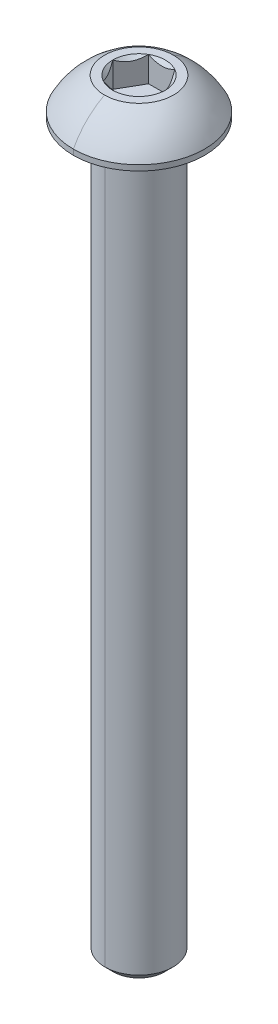
ISO-10303-21;
HEADER;
FILE_DESCRIPTION(('STEP AP214'),'2;1');
FILE_NAME('part.step','',(''),(''),'','','');
FILE_SCHEMA(('AUTOMOTIVE_DESIGN { 1 0 10303 214 1 1 1 1 }'));
ENDSEC;
DATA;
#1=APPLICATION_CONTEXT('core data for automotive mechanical design processes');
#2=APPLICATION_PROTOCOL_DEFINITION('international standard','automotive_design',2000,#1);
#3=PRODUCT_CONTEXT('',#1,'mechanical');
#4=PRODUCT('Part','Part','',(#3));
#5=PRODUCT_RELATED_PRODUCT_CATEGORY('part','',(#4));
#6=PRODUCT_DEFINITION_FORMATION('','',#4);
#7=PRODUCT_DEFINITION_CONTEXT('part definition',#1,'design');
#8=PRODUCT_DEFINITION('design','',#6,#7);
#9=PRODUCT_DEFINITION_SHAPE('','',#8);
#10=(LENGTH_UNIT() NAMED_UNIT(*) SI_UNIT(.MILLI.,.METRE.));
#11=(NAMED_UNIT(*) PLANE_ANGLE_UNIT() SI_UNIT($,.RADIAN.));
#12=(NAMED_UNIT(*) SI_UNIT($,.STERADIAN.) SOLID_ANGLE_UNIT());
#13=UNCERTAINTY_MEASURE_WITH_UNIT(LENGTH_MEASURE(1.E-05),#10,'distance_accuracy_value','');
#14=(GEOMETRIC_REPRESENTATION_CONTEXT(3) GLOBAL_UNCERTAINTY_ASSIGNED_CONTEXT((#13)) GLOBAL_UNIT_ASSIGNED_CONTEXT((#10,
#11,#12)) REPRESENTATION_CONTEXT('',''));
#15=CARTESIAN_POINT('',(0.,0.,0.));
#16=DIRECTION('',(0.,0.,1.));
#17=DIRECTION('',(1.,0.,0.));
#18=AXIS2_PLACEMENT_3D('',#15,#16,#17);
#19=CARTESIAN_POINT('',(0.,-0.152399999999997,0.));
#20=DIRECTION('',(0.,1.,0.));
#21=DIRECTION('',(0.,0.,1.));
#22=AXIS2_PLACEMENT_3D('',#19,#20,#21);
#23=TOROIDAL_SURFACE('',#22,2.5273,0.1524);
#24=CARTESIAN_POINT('',(0.,-0.152399999999997,-2.5273));
#25=DIRECTION('',(1.,0.,0.));
#26=DIRECTION('',(0.,0.,-1.));
#27=AXIS2_PLACEMENT_3D('',#24,#25,#26);
#28=CIRCLE('',#27,0.1524);
#29=CARTESIAN_POINT('',(0.,0.,-2.5273));
#30=VERTEX_POINT('',#29);
#31=CARTESIAN_POINT('',(0.,-0.152399999999997,-2.3749));
#32=VERTEX_POINT('',#31);
#33=EDGE_CURVE('E255',#30,#32,#28,.T.);
#34=ORIENTED_EDGE('',*,*,#33,.F.);
#35=CARTESIAN_POINT('',(0.,0.,0.));
#36=DIRECTION('',(0.,1.,0.));
#37=DIRECTION('',(0.,0.,1.));
#38=AXIS2_PLACEMENT_3D('',#35,#36,#37);
#39=CIRCLE('',#38,2.5273);
#40=CARTESIAN_POINT('',(0.,0.,2.5273));
#41=VERTEX_POINT('',#40);
#42=EDGE_CURVE('E146',#41,#30,#39,.T.);
#43=ORIENTED_EDGE('',*,*,#42,.F.);
#44=CARTESIAN_POINT('',(0.,-0.152399999999997,2.5273));
#45=DIRECTION('',(-1.,0.,0.));
#46=DIRECTION('',(0.,0.,1.));
#47=AXIS2_PLACEMENT_3D('',#44,#45,#46);
#48=CIRCLE('',#47,0.1524);
#49=CARTESIAN_POINT('',(0.,-0.152399999999997,2.3749));
#50=VERTEX_POINT('',#49);
#51=EDGE_CURVE('E199',#41,#50,#48,.T.);
#52=ORIENTED_EDGE('',*,*,#51,.T.);
#53=CARTESIAN_POINT('',(0.,-0.152399999999997,0.));
#54=DIRECTION('',(0.,-1.,0.));
#55=DIRECTION('',(0.,0.,1.));
#56=AXIS2_PLACEMENT_3D('',#53,#54,#55);
#57=CIRCLE('',#56,2.3749);
#58=EDGE_CURVE('E209',#32,#50,#57,.T.);
#59=ORIENTED_EDGE('',*,*,#58,.F.);
#60=EDGE_LOOP('',(#34,#43,#52,#59));
#61=FACE_BOUND('',#60,.T.);
#62=ADVANCED_FACE('F16',(#61),#23,.F.);
#63=CARTESIAN_POINT('',(0.,2.5654,0.));
#64=DIRECTION('',(0.,1.,0.));
#65=DIRECTION('',(0.,0.,1.));
#66=AXIS2_PLACEMENT_3D('',#63,#64,#65);
#67=CONICAL_SURFACE('',#66,1.83308710467706,0.78539816339745);
#68=DIRECTION('',(0.,0.707106781186546,-0.707106781186549));
#69=VECTOR('',#68,1.);
#70=CARTESIAN_POINT('',(0.,2.5654,-1.83308710467706));
#71=LINE('',#70,#69);
#72=CARTESIAN_POINT('',(0.,0.732312895322944,0.));
#73=VERTEX_POINT('',#72);
#74=CARTESIAN_POINT('',(0.,0.7874,-0.0550871046770556));
#75=VERTEX_POINT('',#74);
#76=EDGE_CURVE('E227',#73,#75,#71,.T.);
#77=ORIENTED_EDGE('',*,*,#76,.F.);
#78=DIRECTION('',(0.,0.707106781186546,0.707106781186549));
#79=VECTOR('',#78,1.);
#80=CARTESIAN_POINT('',(0.,2.5654,1.83308710467706));
#81=LINE('',#80,#79);
#82=CARTESIAN_POINT('',(0.,0.7874,0.0550871046770556));
#83=VERTEX_POINT('',#82);
#84=EDGE_CURVE('E203',#73,#83,#81,.T.);
#85=ORIENTED_EDGE('',*,*,#84,.T.);
#86=CARTESIAN_POINT('',(0.,0.7874,0.));
#87=DIRECTION('',(0.,1.,0.));
#88=DIRECTION('',(0.,0.,1.));
#89=AXIS2_PLACEMENT_3D('',#86,#87,#88);
#90=CIRCLE('',#89,0.0550871046770558);
#91=EDGE_CURVE('E188',#83,#75,#90,.T.);
#92=ORIENTED_EDGE('',*,*,#91,.T.);
#93=EDGE_LOOP('',(#77,#85,#92));
#94=FACE_BOUND('',#93,.T.);
#95=ADVANCED_FACE('F295',(#94),#67,.F.);
#96=CARTESIAN_POINT('',(1.83308710467706,0.7874,0.));
#97=DIRECTION('',(0.866025403784439,0.,-0.5));
#98=DIRECTION('',(0.,-1.,0.));
#99=AXIS2_PLACEMENT_3D('',#96,#97,#98);
#100=PLANE('',#99);
#101=DIRECTION('',(0.,1.,0.));
#102=VECTOR('',#101,1.);
#103=CARTESIAN_POINT('',(1.83308710467706,0.7874,0.));
#104=LINE('',#103,#102);
#105=CARTESIAN_POINT('',(1.83308710467706,0.7874,0.));
#106=VERTEX_POINT('',#105);
#107=CARTESIAN_POINT('',(1.83308710467706,2.5654,0.));
#108=VERTEX_POINT('',#107);
#109=EDGE_CURVE('E11',#106,#108,#104,.T.);
#110=ORIENTED_EDGE('',*,*,#109,.T.);
#111=CARTESIAN_POINT('',(1.83308710467706,2.5654,0.));
#112=CARTESIAN_POINT('',(1.58854939316106,2.32086228848399,-0.423551740712339));
#113=CARTESIAN_POINT('',(1.37650342717985,2.31981648546325,-0.790826127331817));
#114=CARTESIAN_POINT('',(1.16317917435944,2.31876437797812,-1.16031457170343));
#115=CARTESIAN_POINT('',(0.91654355233853,2.5654,-1.5875));
#116=B_SPLINE_CURVE_WITH_KNOTS('',2,(#111,#112,#113,#114,#115),.UNSPECIFIED.,.F.,.F.,(3,2,3),
(0.,0.5,1.),.UNSPECIFIED.);
#117=CARTESIAN_POINT('',(0.916543552338531,2.5654,-1.5875));
#118=VERTEX_POINT('',#117);
#119=EDGE_CURVE('E183',#108,#118,#116,.T.);
#120=ORIENTED_EDGE('',*,*,#119,.T.);
#121=DIRECTION('',(0.,1.,0.));
#122=VECTOR('',#121,1.);
#123=CARTESIAN_POINT('',(0.916543552338531,0.7874,-1.5875));
#124=LINE('',#123,#122);
#125=CARTESIAN_POINT('',(0.916543552338531,0.7874,-1.5875));
#126=VERTEX_POINT('',#125);
#127=EDGE_CURVE('E191',#126,#118,#124,.T.);
#128=ORIENTED_EDGE('',*,*,#127,.F.);
#129=DIRECTION('',(-0.5,0.,-0.866025403784439));
#130=VECTOR('',#129,1.);
#131=CARTESIAN_POINT('',(1.83308710467706,0.7874,0.));
#132=LINE('',#131,#130);
#133=EDGE_CURVE('E178',#106,#126,#132,.T.);
#134=ORIENTED_EDGE('',*,*,#133,.F.);
#135=EDGE_LOOP('',(#110,#120,#128,#134));
#136=FACE_BOUND('',#135,.T.);
#137=ADVANCED_FACE('F284',(#136),#100,.F.);
#138=CARTESIAN_POINT('',(0.916543552338531,0.7874,1.5875));
#139=DIRECTION('',(0.866025403784439,0.,0.5));
#140=DIRECTION('',(0.,-1.,0.));
#141=AXIS2_PLACEMENT_3D('',#138,#139,#140);
#142=PLANE('',#141);
#143=DIRECTION('',(0.,1.,0.));
#144=VECTOR('',#143,1.);
#145=CARTESIAN_POINT('',(0.916543552338531,0.7874,1.5875));
#146=LINE('',#145,#144);
#147=CARTESIAN_POINT('',(0.916543552338531,0.7874,1.5875));
#148=VERTEX_POINT('',#147);
#149=CARTESIAN_POINT('',(0.916543552338531,2.5654,1.5875));
#150=VERTEX_POINT('',#149);
#151=EDGE_CURVE('E30',#148,#150,#146,.T.);
#152=ORIENTED_EDGE('',*,*,#151,.T.);
#153=CARTESIAN_POINT('',(0.916543552338531,2.5654,1.5875));
#154=CARTESIAN_POINT('',(1.16108126385472,2.32086228848382,1.16394825928734));
#155=CARTESIAN_POINT('',(1.37312722983574,2.31981648546325,0.796673872668184));
#156=CARTESIAN_POINT('',(1.58645148265633,2.3187643779783,0.427185428296259));
#157=CARTESIAN_POINT('',(1.83308710467706,2.5654,0.));
#158=B_SPLINE_CURVE_WITH_KNOTS('',2,(#153,#154,#155,#156,#157),.UNSPECIFIED.,.F.,.F.,(3,2,3),
(0.,0.5,1.),.UNSPECIFIED.);
#159=EDGE_CURVE('E327',#150,#108,#158,.T.);
#160=ORIENTED_EDGE('',*,*,#159,.T.);
#161=ORIENTED_EDGE('',*,*,#109,.F.);
#162=DIRECTION('',(0.5,0.,-0.866025403784439));
#163=VECTOR('',#162,1.);
#164=CARTESIAN_POINT('',(0.916543552338531,0.7874,1.5875));
#165=LINE('',#164,#163);
#166=EDGE_CURVE('E192',#148,#106,#165,.T.);
#167=ORIENTED_EDGE('',*,*,#166,.F.);
#168=EDGE_LOOP('',(#152,#160,#161,#167));
#169=FACE_BOUND('',#168,.T.);
#170=ADVANCED_FACE('F294',(#169),#142,.F.);
#171=CARTESIAN_POINT('',(-0.91654355233853,0.7874,1.5875));
#172=DIRECTION('',(0.,0.,1.));
#173=DIRECTION('',(1.,0.,0.));
#174=AXIS2_PLACEMENT_3D('',#171,#172,#173);
#175=PLANE('',#174);
#176=DIRECTION('',(0.,1.,0.));
#177=VECTOR('',#176,1.);
#178=CARTESIAN_POINT('',(-0.91654355233853,0.7874,1.5875));
#179=LINE('',#178,#177);
#180=CARTESIAN_POINT('',(-0.91654355233853,0.7874,1.5875));
#181=VERTEX_POINT('',#180);
#182=CARTESIAN_POINT('',(-0.91654355233853,2.5654,1.5875));
#183=VERTEX_POINT('',#182);
#184=EDGE_CURVE('E410',#181,#183,#179,.T.);
#185=ORIENTED_EDGE('',*,*,#184,.T.);
#186=CARTESIAN_POINT('',(-0.916543552338531,2.5654,1.5875));
#187=CARTESIAN_POINT('',(-0.684381010738564,2.44931872920002,1.5875));
#188=CARTESIAN_POINT('',(-0.4718738638875,2.38845938444161,1.5875));
#189=CARTESIAN_POINT('',(-0.232175759974894,2.31981289532294,1.5875));
#190=CARTESIAN_POINT('',(0.,2.31981289532294,1.5875));
#191=B_SPLINE_CURVE_WITH_KNOTS('',2,(#186,#187,#188,#189,#190),.UNSPECIFIED.,.F.,.F.,(3,2,3),
(0.,0.5,1.),.UNSPECIFIED.);
#192=CARTESIAN_POINT('',(0.,2.31981289532294,1.5875));
#193=VERTEX_POINT('',#192);
#194=EDGE_CURVE('E405',#183,#193,#191,.T.);
#195=ORIENTED_EDGE('',*,*,#194,.T.);
#196=CARTESIAN_POINT('',(0.,2.31981289532294,1.5875));
#197=CARTESIAN_POINT('',(0.229732695645398,2.31981289532294,1.5875));
#198=CARTESIAN_POINT('',(0.471961624215038,2.3884843914945,1.5875));
#199=CARTESIAN_POINT('',(0.68154594324368,2.44790119545257,1.5875));
#200=CARTESIAN_POINT('',(0.91654355233853,2.5654,1.5875));
#201=B_SPLINE_CURVE_WITH_KNOTS('',2,(#196,#197,#198,#199,#200),.UNSPECIFIED.,.F.,.F.,(3,2,3),
(0.,0.5,1.),.UNSPECIFIED.);
#202=EDGE_CURVE('E226',#193,#150,#201,.T.);
#203=ORIENTED_EDGE('',*,*,#202,.T.);
#204=ORIENTED_EDGE('',*,*,#151,.F.);
#205=DIRECTION('',(1.,0.,0.));
#206=VECTOR('',#205,1.);
#207=CARTESIAN_POINT('',(-0.91654355233853,0.7874,1.5875));
#208=LINE('',#207,#206);
#209=EDGE_CURVE('E197',#181,#148,#208,.T.);
#210=ORIENTED_EDGE('',*,*,#209,.F.);
#211=EDGE_LOOP('',(#185,#195,#203,#204,#210));
#212=FACE_BOUND('',#211,.T.);
#213=ADVANCED_FACE('F18',(#212),#175,.F.);
#214=CARTESIAN_POINT('',(-1.83308710467706,0.7874,0.));
#215=DIRECTION('',(-0.866025403784439,0.,0.5));
#216=DIRECTION('',(0.,1.,0.));
#217=AXIS2_PLACEMENT_3D('',#214,#215,#216);
#218=PLANE('',#217);
#219=DIRECTION('',(0.,1.,0.));
#220=VECTOR('',#219,1.);
#221=CARTESIAN_POINT('',(-1.83308710467706,0.7874,0.));
#222=LINE('',#221,#220);
#223=CARTESIAN_POINT('',(-1.83308710467706,0.7874,0.));
#224=VERTEX_POINT('',#223);
#225=CARTESIAN_POINT('',(-1.83308710467706,2.5654,0.));
#226=VERTEX_POINT('',#225);
#227=EDGE_CURVE('E471',#224,#226,#222,.T.);
#228=ORIENTED_EDGE('',*,*,#227,.T.);
#229=CARTESIAN_POINT('',(-1.83308710467706,2.5654,0.));
#230=CARTESIAN_POINT('',(-1.58854939316106,2.32086228848399,0.423551740712331));
#231=CARTESIAN_POINT('',(-1.37650342717985,2.31981648546325,0.790826127331817));
#232=CARTESIAN_POINT('',(-1.16317917435944,2.31876437797812,1.16031457170343));
#233=CARTESIAN_POINT('',(-0.91654355233853,2.5654,1.5875));
#234=B_SPLINE_CURVE_WITH_KNOTS('',2,(#229,#230,#231,#232,#233),.UNSPECIFIED.,.F.,.F.,(3,2,3),
(0.,0.5,1.),.UNSPECIFIED.);
#235=EDGE_CURVE('E415',#226,#183,#234,.T.);
#236=ORIENTED_EDGE('',*,*,#235,.T.);
#237=ORIENTED_EDGE('',*,*,#184,.F.);
#238=DIRECTION('',(0.5,0.,0.866025403784438));
#239=VECTOR('',#238,1.);
#240=CARTESIAN_POINT('',(-1.83308710467706,0.7874,0.));
#241=LINE('',#240,#239);
#242=EDGE_CURVE('E193',#224,#181,#241,.T.);
#243=ORIENTED_EDGE('',*,*,#242,.F.);
#244=EDGE_LOOP('',(#228,#236,#237,#243));
#245=FACE_BOUND('',#244,.T.);
#246=ADVANCED_FACE('F496',(#245),#218,.F.);
#247=CARTESIAN_POINT('',(-0.916543552338531,0.7874,-1.5875));
#248=DIRECTION('',(-0.866025403784439,0.,-0.5));
#249=DIRECTION('',(-0.5,0.,0.866025403784439));
#250=AXIS2_PLACEMENT_3D('',#247,#248,#249);
#251=PLANE('',#250);
#252=DIRECTION('',(0.,1.,0.));
#253=VECTOR('',#252,1.);
#254=CARTESIAN_POINT('',(-0.916543552338531,0.7874,-1.5875));
#255=LINE('',#254,#253);
#256=CARTESIAN_POINT('',(-0.916543552338531,0.7874,-1.5875));
#257=VERTEX_POINT('',#256);
#258=CARTESIAN_POINT('',(-0.916543552338531,2.5654,-1.5875));
#259=VERTEX_POINT('',#258);
#260=EDGE_CURVE('E528',#257,#259,#255,.T.);
#261=ORIENTED_EDGE('',*,*,#260,.T.);
#262=CARTESIAN_POINT('',(-0.916543552338531,2.5654,-1.5875));
#263=CARTESIAN_POINT('',(-1.16108126385453,2.320862288484,-1.16394825928767));
#264=CARTESIAN_POINT('',(-1.37312722983574,2.31981648546325,-0.796673872668183));
#265=CARTESIAN_POINT('',(-1.58645148265615,2.31876437797813,-0.427185428296571));
#266=CARTESIAN_POINT('',(-1.83308710467706,2.5654,0.));
#267=B_SPLINE_CURVE_WITH_KNOTS('',2,(#262,#263,#264,#265,#266),.UNSPECIFIED.,.F.,.F.,(3,2,3),
(0.,0.5,1.),.UNSPECIFIED.);
#268=EDGE_CURVE('E544',#259,#226,#267,.T.);
#269=ORIENTED_EDGE('',*,*,#268,.T.);
#270=ORIENTED_EDGE('',*,*,#227,.F.);
#271=DIRECTION('',(-0.5,0.,0.866025403784439));
#272=VECTOR('',#271,1.);
#273=CARTESIAN_POINT('',(-0.916543552338531,0.7874,-1.5875));
#274=LINE('',#273,#272);
#275=EDGE_CURVE('E198',#257,#224,#274,.T.);
#276=ORIENTED_EDGE('',*,*,#275,.F.);
#277=EDGE_LOOP('',(#261,#269,#270,#276));
#278=FACE_BOUND('',#277,.T.);
#279=ADVANCED_FACE('F506',(#278),#251,.F.);
#280=CARTESIAN_POINT('',(0.916543552338531,0.7874,-1.5875));
#281=DIRECTION('',(0.,0.,-1.));
#282=DIRECTION('',(-1.,0.,0.));
#283=AXIS2_PLACEMENT_3D('',#280,#281,#282);
#284=PLANE('',#283);
#285=ORIENTED_EDGE('',*,*,#127,.T.);
#286=CARTESIAN_POINT('',(0.916543552338531,2.5654,-1.5875));
#287=CARTESIAN_POINT('',(0.68330023814449,2.44877834290298,-1.5875));
#288=CARTESIAN_POINT('',(0.472022049766507,2.38850161206546,-1.5875));
#289=CARTESIAN_POINT('',(0.231606862063275,2.31991222444484,-1.5875));
#290=CARTESIAN_POINT('',(0.000126990617285933,2.31981290040219,-1.5875));
#291=CARTESIAN_POINT('',(-0.230319895797069,2.3197140195957,-1.5875));
#292=CARTESIAN_POINT('',(-0.471813597713689,2.38844221424328,-1.5875));
#293=CARTESIAN_POINT('',(-0.682613944360854,2.44843519601116,-1.5875));
#294=CARTESIAN_POINT('',(-0.916543552338529,2.5654,-1.5875));
#295=B_SPLINE_CURVE_WITH_KNOTS('',2,(#286,#287,#288,#289,#290,#291,#292,#293,#294),
.UNSPECIFIED.,.F.,.F.,(3,2,2,2,3),(0.,0.25,0.5,0.75,1.),.UNSPECIFIED.);
#296=EDGE_CURVE('E524',#118,#259,#295,.T.);
#297=ORIENTED_EDGE('',*,*,#296,.T.);
#298=ORIENTED_EDGE('',*,*,#260,.F.);
#299=DIRECTION('',(-1.,0.,0.));
#300=VECTOR('',#299,1.);
#301=CARTESIAN_POINT('',(0.916543552338531,0.7874,-1.5875));
#302=LINE('',#301,#300);
#303=EDGE_CURVE('E182',#126,#257,#302,.T.);
#304=ORIENTED_EDGE('',*,*,#303,.F.);
#305=EDGE_LOOP('',(#285,#297,#298,#304));
#306=FACE_BOUND('',#305,.T.);
#307=ADVANCED_FACE('F508',(#306),#284,.F.);
#308=CARTESIAN_POINT('',(0.,0.7874,0.));
#309=DIRECTION('',(0.,1.,0.));
#310=DIRECTION('',(1.,0.,0.));
#311=AXIS2_PLACEMENT_3D('',#308,#309,#310);
#312=PLANE('',#311);
#313=ORIENTED_EDGE('',*,*,#91,.F.);
#314=CARTESIAN_POINT('',(0.,0.7874,0.));
#315=DIRECTION('',(0.,1.,0.));
#316=DIRECTION('',(0.,0.,1.));
#317=AXIS2_PLACEMENT_3D('',#314,#315,#316);
#318=CIRCLE('',#317,0.0550871046770558);
#319=EDGE_CURVE('E222',#75,#83,#318,.T.);
#320=ORIENTED_EDGE('',*,*,#319,.F.);
#321=EDGE_LOOP('',(#313,#320));
#322=FACE_BOUND('',#321,.T.);
#323=ORIENTED_EDGE('',*,*,#133,.T.);
#324=ORIENTED_EDGE('',*,*,#303,.T.);
#325=ORIENTED_EDGE('',*,*,#275,.T.);
#326=ORIENTED_EDGE('',*,*,#242,.T.);
#327=ORIENTED_EDGE('',*,*,#209,.T.);
#328=ORIENTED_EDGE('',*,*,#166,.T.);
#329=EDGE_LOOP('',(#323,#324,#325,#326,#327,#328));
#330=FACE_BOUND('',#329,.T.);
#331=ADVANCED_FACE('F507',(#322,#330),#312,.T.);
#332=CARTESIAN_POINT('',(0.,2.5654,0.));
#333=DIRECTION('',(0.,1.,0.));
#334=DIRECTION('',(0.,0.,1.));
#335=AXIS2_PLACEMENT_3D('',#332,#333,#334);
#336=CONICAL_SURFACE('',#335,1.83308710467706,0.78539816339745);
#337=CARTESIAN_POINT('',(0.,2.5654,0.));
#338=DIRECTION('',(0.,1.,0.));
#339=DIRECTION('',(0.,0.,1.));
#340=AXIS2_PLACEMENT_3D('',#337,#338,#339);
#341=CIRCLE('',#340,1.83308710467706);
#342=EDGE_CURVE('E1099',#108,#118,#341,.T.);
#343=ORIENTED_EDGE('',*,*,#342,.T.);
#344=ORIENTED_EDGE('',*,*,#119,.F.);
#345=EDGE_LOOP('',(#343,#344));
#346=FACE_BOUND('',#345,.T.);
#347=ADVANCED_FACE('F344',(#346),#336,.F.);
#348=CARTESIAN_POINT('',(0.,2.5654,0.));
#349=DIRECTION('',(0.,1.,0.));
#350=DIRECTION('',(0.,0.,1.));
#351=AXIS2_PLACEMENT_3D('',#348,#349,#350);
#352=CONICAL_SURFACE('',#351,1.83308710467706,0.78539816339745);
#353=CARTESIAN_POINT('',(0.,2.5654,0.));
#354=DIRECTION('',(0.,1.,0.));
#355=DIRECTION('',(0.,0.,1.));
#356=AXIS2_PLACEMENT_3D('',#353,#354,#355);
#357=CIRCLE('',#356,1.83308710467706);
#358=EDGE_CURVE('E483',#150,#108,#357,.T.);
#359=ORIENTED_EDGE('',*,*,#358,.T.);
#360=ORIENTED_EDGE('',*,*,#159,.F.);
#361=EDGE_LOOP('',(#359,#360));
#362=FACE_BOUND('',#361,.T.);
#363=ADVANCED_FACE('F334',(#362),#352,.F.);
#364=CARTESIAN_POINT('',(0.,2.5654,0.));
#365=DIRECTION('',(0.,1.,0.));
#366=DIRECTION('',(0.,0.,1.));
#367=AXIS2_PLACEMENT_3D('',#364,#365,#366);
#368=CONICAL_SURFACE('',#367,1.83308710467706,0.78539816339745);
#369=DIRECTION('',(0.,0.707106781186546,0.707106781186549));
#370=VECTOR('',#369,1.);
#371=CARTESIAN_POINT('',(0.,2.5654,1.83308710467706));
#372=LINE('',#371,#370);
#373=CARTESIAN_POINT('',(0.,2.5654,1.83308710467706));
#374=VERTEX_POINT('',#373);
#375=EDGE_CURVE('E419',#193,#374,#372,.T.);
#376=ORIENTED_EDGE('',*,*,#375,.F.);
#377=ORIENTED_EDGE('',*,*,#194,.F.);
#378=CARTESIAN_POINT('',(0.,2.5654,0.));
#379=DIRECTION('',(0.,1.,0.));
#380=DIRECTION('',(0.,0.,1.));
#381=AXIS2_PLACEMENT_3D('',#378,#379,#380);
#382=CIRCLE('',#381,1.83308710467706);
#383=EDGE_CURVE('E421',#183,#374,#382,.T.);
#384=ORIENTED_EDGE('',*,*,#383,.T.);
#385=EDGE_LOOP('',(#376,#377,#384));
#386=FACE_BOUND('',#385,.T.);
#387=ADVANCED_FACE('F343',(#386),#368,.F.);
#388=CARTESIAN_POINT('',(0.,2.5654,0.));
#389=DIRECTION('',(0.,1.,0.));
#390=DIRECTION('',(0.,0.,1.));
#391=AXIS2_PLACEMENT_3D('',#388,#389,#390);
#392=CONICAL_SURFACE('',#391,1.83308710467706,0.78539816339745);
#393=CARTESIAN_POINT('',(0.,2.5654,0.));
#394=DIRECTION('',(0.,1.,0.));
#395=DIRECTION('',(0.,0.,1.));
#396=AXIS2_PLACEMENT_3D('',#393,#394,#395);
#397=CIRCLE('',#396,1.83308710467706);
#398=EDGE_CURVE('E474',#226,#183,#397,.T.);
#399=ORIENTED_EDGE('',*,*,#398,.T.);
#400=ORIENTED_EDGE('',*,*,#235,.F.);
#401=EDGE_LOOP('',(#399,#400));
#402=FACE_BOUND('',#401,.T.);
#403=ADVANCED_FACE('F458',(#402),#392,.F.);
#404=CARTESIAN_POINT('',(0.,2.5654,0.));
#405=DIRECTION('',(0.,1.,0.));
#406=DIRECTION('',(0.,0.,1.));
#407=AXIS2_PLACEMENT_3D('',#404,#405,#406);
#408=CONICAL_SURFACE('',#407,1.83308710467706,0.78539816339745);
#409=CARTESIAN_POINT('',(0.,2.5654,0.));
#410=DIRECTION('',(0.,1.,0.));
#411=DIRECTION('',(0.,0.,1.));
#412=AXIS2_PLACEMENT_3D('',#409,#410,#411);
#413=CIRCLE('',#412,1.83308710467706);
#414=EDGE_CURVE('E478',#259,#226,#413,.T.);
#415=ORIENTED_EDGE('',*,*,#414,.T.);
#416=ORIENTED_EDGE('',*,*,#268,.F.);
#417=EDGE_LOOP('',(#415,#416));
#418=FACE_BOUND('',#417,.T.);
#419=ADVANCED_FACE('F296',(#418),#408,.F.);
#420=CARTESIAN_POINT('',(0.,2.5654,0.));
#421=DIRECTION('',(0.,1.,0.));
#422=DIRECTION('',(0.,0.,1.));
#423=AXIS2_PLACEMENT_3D('',#420,#421,#422);
#424=CONICAL_SURFACE('',#423,1.83308710467706,0.78539816339745);
#425=CARTESIAN_POINT('',(0.,2.5654,0.));
#426=DIRECTION('',(0.,1.,0.));
#427=DIRECTION('',(0.,0.,1.));
#428=AXIS2_PLACEMENT_3D('',#425,#426,#427);
#429=CIRCLE('',#428,1.83308710467706);
#430=EDGE_CURVE('E250',#118,#259,#429,.T.);
#431=ORIENTED_EDGE('',*,*,#430,.T.);
#432=ORIENTED_EDGE('',*,*,#296,.F.);
#433=EDGE_LOOP('',(#431,#432));
#434=FACE_BOUND('',#433,.T.);
#435=ADVANCED_FACE('F444',(#434),#424,.F.);
#436=CARTESIAN_POINT('',(0.,2.5654,-2.413));
#437=DIRECTION('',(0.,-1.,0.));
#438=DIRECTION('',(0.,0.,-1.));
#439=AXIS2_PLACEMENT_3D('',#436,#437,#438);
#440=PLANE('',#439);
#441=ORIENTED_EDGE('',*,*,#430,.F.);
#442=ORIENTED_EDGE('',*,*,#342,.F.);
#443=ORIENTED_EDGE('',*,*,#358,.F.);
#444=CARTESIAN_POINT('',(0.,2.5654,0.));
#445=DIRECTION('',(0.,1.,0.));
#446=DIRECTION('',(0.,0.,1.));
#447=AXIS2_PLACEMENT_3D('',#444,#445,#446);
#448=CIRCLE('',#447,1.83308710467706);
#449=EDGE_CURVE('E426',#374,#150,#448,.T.);
#450=ORIENTED_EDGE('',*,*,#449,.F.);
#451=ORIENTED_EDGE('',*,*,#383,.F.);
#452=ORIENTED_EDGE('',*,*,#398,.F.);
#453=ORIENTED_EDGE('',*,*,#414,.F.);
#454=EDGE_LOOP('',(#441,#442,#443,#450,#451,#452,#453));
#455=FACE_BOUND('',#454,.T.);
#456=CARTESIAN_POINT('',(0.,2.5654,0.));
#457=DIRECTION('',(0.,1.,0.));
#458=DIRECTION('',(0.,0.,1.));
#459=AXIS2_PLACEMENT_3D('',#456,#457,#458);
#460=CIRCLE('',#459,2.413);
#461=CARTESIAN_POINT('',(0.,2.5654,2.413));
#462=VERTEX_POINT('',#461);
#463=CARTESIAN_POINT('',(0.,2.5654,-2.413));
#464=VERTEX_POINT('',#463);
#465=EDGE_CURVE('E169',#462,#464,#460,.T.);
#466=ORIENTED_EDGE('',*,*,#465,.T.);
#467=CARTESIAN_POINT('',(0.,2.5654,0.));
#468=DIRECTION('',(0.,1.,0.));
#469=DIRECTION('',(0.,0.,1.));
#470=AXIS2_PLACEMENT_3D('',#467,#468,#469);
#471=CIRCLE('',#470,2.413);
#472=EDGE_CURVE('E247',#464,#462,#471,.T.);
#473=ORIENTED_EDGE('',*,*,#472,.T.);
#474=EDGE_LOOP('',(#466,#473));
#475=FACE_BOUND('',#474,.T.);
#476=ADVANCED_FACE('F454',(#455,#475),#440,.F.);
#477=CARTESIAN_POINT('',(0.,-1.9398474797777,0.));
#478=DIRECTION('',(0.,1.,0.));
#479=DIRECTION('',(0.,0.,1.));
#480=AXIS2_PLACEMENT_3D('',#477,#478,#479);
#481=DEGENERATE_TOROIDAL_SURFACE('',#480,0.065843178235288,5.08,.T.);
#482=CARTESIAN_POINT('',(0.,-1.9398474797777,-0.065843178235288));
#483=DIRECTION('',(1.,0.,0.));
#484=DIRECTION('',(0.,0.,-1.));
#485=AXIS2_PLACEMENT_3D('',#482,#483,#484);
#486=CIRCLE('',#485,5.08);
#487=CARTESIAN_POINT('',(0.,0.381,-4.5847));
#488=VERTEX_POINT('',#487);
#489=EDGE_CURVE('E205',#488,#464,#486,.T.);
#490=ORIENTED_EDGE('',*,*,#489,.F.);
#491=CARTESIAN_POINT('',(0.,0.381,0.));
#492=DIRECTION('',(0.,1.,0.));
#493=DIRECTION('',(0.,0.,1.));
#494=AXIS2_PLACEMENT_3D('',#491,#492,#493);
#495=CIRCLE('',#494,4.5847);
#496=CARTESIAN_POINT('',(0.,0.381,4.5847));
#497=VERTEX_POINT('',#496);
#498=EDGE_CURVE('E251',#488,#497,#495,.T.);
#499=ORIENTED_EDGE('',*,*,#498,.T.);
#500=CARTESIAN_POINT('',(0.,-1.9398474797777,0.065843178235288));
#501=DIRECTION('',(-1.,0.,0.));
#502=DIRECTION('',(0.,0.,1.));
#503=AXIS2_PLACEMENT_3D('',#500,#501,#502);
#504=CIRCLE('',#503,5.08);
#505=EDGE_CURVE('E160',#497,#462,#504,.T.);
#506=ORIENTED_EDGE('',*,*,#505,.T.);
#507=ORIENTED_EDGE('',*,*,#472,.F.);
#508=EDGE_LOOP('',(#490,#499,#506,#507));
#509=FACE_BOUND('',#508,.T.);
#510=ADVANCED_FACE('F561',(#509),#481,.T.);
#511=CARTESIAN_POINT('',(0.,2.5654,0.));
#512=DIRECTION('',(0.,1.,0.));
#513=DIRECTION('',(0.,0.,1.));
#514=AXIS2_PLACEMENT_3D('',#511,#512,#513);
#515=CYLINDRICAL_SURFACE('',#514,4.5847);
#516=DIRECTION('',(0.,1.,0.));
#517=VECTOR('',#516,1.);
#518=CARTESIAN_POINT('',(0.,2.5654,-4.5847));
#519=LINE('',#518,#517);
#520=CARTESIAN_POINT('',(0.,0.,-4.5847));
#521=VERTEX_POINT('',#520);
#522=EDGE_CURVE('E141',#521,#488,#519,.T.);
#523=ORIENTED_EDGE('',*,*,#522,.F.);
#524=CARTESIAN_POINT('',(0.,0.,0.));
#525=DIRECTION('',(0.,1.,0.));
#526=DIRECTION('',(0.,0.,1.));
#527=AXIS2_PLACEMENT_3D('',#524,#525,#526);
#528=CIRCLE('',#527,4.5847);
#529=CARTESIAN_POINT('',(0.,0.,4.5847));
#530=VERTEX_POINT('',#529);
#531=EDGE_CURVE('E135',#521,#530,#528,.T.);
#532=ORIENTED_EDGE('',*,*,#531,.T.);
#533=DIRECTION('',(0.,1.,0.));
#534=VECTOR('',#533,1.);
#535=CARTESIAN_POINT('',(0.,2.5654,4.5847));
#536=LINE('',#535,#534);
#537=EDGE_CURVE('E138',#530,#497,#536,.T.);
#538=ORIENTED_EDGE('',*,*,#537,.T.);
#539=ORIENTED_EDGE('',*,*,#498,.F.);
#540=EDGE_LOOP('',(#523,#532,#538,#539));
#541=FACE_BOUND('',#540,.T.);
#542=ADVANCED_FACE('F137',(#541),#515,.T.);
#543=CARTESIAN_POINT('',(0.,0.,0.));
#544=DIRECTION('',(0.,1.,0.));
#545=DIRECTION('',(1.,0.,0.));
#546=AXIS2_PLACEMENT_3D('',#543,#544,#545);
#547=PLANE('',#546);
#548=ORIENTED_EDGE('',*,*,#42,.T.);
#549=CARTESIAN_POINT('',(0.,0.,0.));
#550=DIRECTION('',(0.,1.,0.));
#551=DIRECTION('',(0.,0.,1.));
#552=AXIS2_PLACEMENT_3D('',#549,#550,#551);
#553=CIRCLE('',#552,2.5273);
#554=EDGE_CURVE('E252',#30,#41,#553,.T.);
#555=ORIENTED_EDGE('',*,*,#554,.T.);
#556=EDGE_LOOP('',(#548,#555));
#557=FACE_BOUND('',#556,.T.);
#558=CARTESIAN_POINT('',(0.,0.,0.));
#559=DIRECTION('',(0.,1.,0.));
#560=DIRECTION('',(0.,0.,1.));
#561=AXIS2_PLACEMENT_3D('',#558,#559,#560);
#562=CIRCLE('',#561,4.5847);
#563=EDGE_CURVE('E152',#530,#521,#562,.T.);
#564=ORIENTED_EDGE('',*,*,#563,.F.);
#565=ORIENTED_EDGE('',*,*,#531,.F.);
#566=EDGE_LOOP('',(#564,#565));
#567=FACE_BOUND('',#566,.T.);
#568=ADVANCED_FACE('F158',(#557,#567),#547,.F.);
#569=CARTESIAN_POINT('',(0.,-50.2158,0.));
#570=DIRECTION('',(0.,1.,0.));
#571=DIRECTION('',(0.,0.,1.));
#572=AXIS2_PLACEMENT_3D('',#569,#570,#571);
#573=CONICAL_SURFACE('',#572,2.3749,0.785398163397443);
#574=DIRECTION('',(0.,0.707106781186551,-0.707106781186544));
#575=VECTOR('',#574,1.);
#576=CARTESIAN_POINT('',(0.,-50.2158,-2.3749));
#577=LINE('',#576,#575);
#578=CARTESIAN_POINT('',(0.,-50.8,-1.7907));
#579=VERTEX_POINT('',#578);
#580=CARTESIAN_POINT('',(0.,-50.2158,-2.3749));
#581=VERTEX_POINT('',#580);
#582=EDGE_CURVE('E187',#579,#581,#577,.T.);
#583=ORIENTED_EDGE('',*,*,#582,.F.);
#584=CARTESIAN_POINT('',(0.,-50.8,0.));
#585=DIRECTION('',(0.,-1.,0.));
#586=DIRECTION('',(0.,0.,1.));
#587=AXIS2_PLACEMENT_3D('',#584,#585,#586);
#588=CIRCLE('',#587,1.7907);
#589=CARTESIAN_POINT('',(0.,-50.8,1.7907));
#590=VERTEX_POINT('',#589);
#591=EDGE_CURVE('E147',#590,#579,#588,.T.);
#592=ORIENTED_EDGE('',*,*,#591,.F.);
#593=DIRECTION('',(0.,0.707106781186551,0.707106781186544));
#594=VECTOR('',#593,1.);
#595=CARTESIAN_POINT('',(0.,-50.2158,2.3749));
#596=LINE('',#595,#594);
#597=CARTESIAN_POINT('',(0.,-50.2158,2.3749));
#598=VERTEX_POINT('',#597);
#599=EDGE_CURVE('E237',#590,#598,#596,.T.);
#600=ORIENTED_EDGE('',*,*,#599,.T.);
#601=CARTESIAN_POINT('',(0.,-50.2158,0.));
#602=DIRECTION('',(0.,1.,0.));
#603=DIRECTION('',(0.,0.,1.));
#604=AXIS2_PLACEMENT_3D('',#601,#602,#603);
#605=CIRCLE('',#604,2.3749);
#606=EDGE_CURVE('E177',#581,#598,#605,.T.);
#607=ORIENTED_EDGE('',*,*,#606,.F.);
#608=EDGE_LOOP('',(#583,#592,#600,#607));
#609=FACE_BOUND('',#608,.T.);
#610=ADVANCED_FACE('F346',(#609),#573,.T.);
#611=CARTESIAN_POINT('',(0.,-50.8,0.));
#612=DIRECTION('',(0.,1.,0.));
#613=DIRECTION('',(1.,0.,0.));
#614=AXIS2_PLACEMENT_3D('',#611,#612,#613);
#615=PLANE('',#614);
#616=ORIENTED_EDGE('',*,*,#591,.T.);
#617=CARTESIAN_POINT('',(0.,-50.8,0.));
#618=DIRECTION('',(0.,-1.,0.));
#619=DIRECTION('',(0.,0.,1.));
#620=AXIS2_PLACEMENT_3D('',#617,#618,#619);
#621=CIRCLE('',#620,1.7907);
#622=EDGE_CURVE('E156',#579,#590,#621,.T.);
#623=ORIENTED_EDGE('',*,*,#622,.T.);
#624=EDGE_LOOP('',(#616,#623));
#625=FACE_BOUND('',#624,.T.);
#626=ADVANCED_FACE('F303',(#625),#615,.F.);
#627=CARTESIAN_POINT('',(0.,-50.8,0.));
#628=DIRECTION('',(0.,1.,0.));
#629=DIRECTION('',(0.,0.,1.));
#630=AXIS2_PLACEMENT_3D('',#627,#628,#629);
#631=CYLINDRICAL_SURFACE('',#630,2.3749);
#632=DIRECTION('',(0.,1.,0.));
#633=VECTOR('',#632,1.);
#634=CARTESIAN_POINT('',(0.,-50.8,-2.3749));
#635=LINE('',#634,#633);
#636=EDGE_CURVE('E214',#581,#32,#635,.T.);
#637=ORIENTED_EDGE('',*,*,#636,.F.);
#638=ORIENTED_EDGE('',*,*,#606,.T.);
#639=DIRECTION('',(0.,1.,0.));
#640=VECTOR('',#639,1.);
#641=CARTESIAN_POINT('',(0.,-50.8,2.3749));
#642=LINE('',#641,#640);
#643=EDGE_CURVE('E213',#598,#50,#642,.T.);
#644=ORIENTED_EDGE('',*,*,#643,.T.);
#645=CARTESIAN_POINT('',(0.,-0.152399999999997,0.));
#646=DIRECTION('',(0.,-1.,0.));
#647=DIRECTION('',(0.,0.,1.));
#648=AXIS2_PLACEMENT_3D('',#645,#646,#647);
#649=CIRCLE('',#648,2.3749);
#650=EDGE_CURVE('E204',#50,#32,#649,.T.);
#651=ORIENTED_EDGE('',*,*,#650,.T.);
#652=EDGE_LOOP('',(#637,#638,#644,#651));
#653=FACE_BOUND('',#652,.T.);
#654=ADVANCED_FACE('F299',(#653),#631,.T.);
#655=CARTESIAN_POINT('',(0.,-50.8,0.));
#656=DIRECTION('',(0.,1.,0.));
#657=DIRECTION('',(0.,0.,1.));
#658=AXIS2_PLACEMENT_3D('',#655,#656,#657);
#659=CYLINDRICAL_SURFACE('',#658,2.3749);
#660=CARTESIAN_POINT('',(0.,-50.2158,0.));
#661=DIRECTION('',(0.,1.,0.));
#662=DIRECTION('',(0.,0.,1.));
#663=AXIS2_PLACEMENT_3D('',#660,#661,#662);
#664=CIRCLE('',#663,2.3749);
#665=EDGE_CURVE('E218',#598,#581,#664,.T.);
#666=ORIENTED_EDGE('',*,*,#665,.T.);
#667=ORIENTED_EDGE('',*,*,#636,.T.);
#668=ORIENTED_EDGE('',*,*,#58,.T.);
#669=ORIENTED_EDGE('',*,*,#643,.F.);
#670=EDGE_LOOP('',(#666,#667,#668,#669));
#671=FACE_BOUND('',#670,.T.);
#672=ADVANCED_FACE('F302',(#671),#659,.T.);
#673=CARTESIAN_POINT('',(0.,-50.2158,0.));
#674=DIRECTION('',(0.,1.,0.));
#675=DIRECTION('',(0.,0.,1.));
#676=AXIS2_PLACEMENT_3D('',#673,#674,#675);
#677=CONICAL_SURFACE('',#676,2.3749,0.785398163397443);
#678=ORIENTED_EDGE('',*,*,#622,.F.);
#679=ORIENTED_EDGE('',*,*,#582,.T.);
#680=ORIENTED_EDGE('',*,*,#665,.F.);
#681=ORIENTED_EDGE('',*,*,#599,.F.);
#682=EDGE_LOOP('',(#678,#679,#680,#681));
#683=FACE_BOUND('',#682,.T.);
#684=ADVANCED_FACE('F567',(#683),#677,.T.);
#685=CARTESIAN_POINT('',(0.,2.5654,0.));
#686=DIRECTION('',(0.,1.,0.));
#687=DIRECTION('',(0.,0.,1.));
#688=AXIS2_PLACEMENT_3D('',#685,#686,#687);
#689=CYLINDRICAL_SURFACE('',#688,4.5847);
#690=ORIENTED_EDGE('',*,*,#563,.T.);
#691=ORIENTED_EDGE('',*,*,#522,.T.);
#692=CARTESIAN_POINT('',(0.,0.381,0.));
#693=DIRECTION('',(0.,1.,0.));
#694=DIRECTION('',(0.,0.,1.));
#695=AXIS2_PLACEMENT_3D('',#692,#693,#694);
#696=CIRCLE('',#695,4.5847);
#697=EDGE_CURVE('E154',#497,#488,#696,.T.);
#698=ORIENTED_EDGE('',*,*,#697,.F.);
#699=ORIENTED_EDGE('',*,*,#537,.F.);
#700=EDGE_LOOP('',(#690,#691,#698,#699));
#701=FACE_BOUND('',#700,.T.);
#702=ADVANCED_FACE('F151',(#701),#689,.T.);
#703=CARTESIAN_POINT('',(0.,-1.9398474797777,0.));
#704=DIRECTION('',(0.,1.,0.));
#705=DIRECTION('',(0.,0.,1.));
#706=AXIS2_PLACEMENT_3D('',#703,#704,#705);
#707=DEGENERATE_TOROIDAL_SURFACE('',#706,0.065843178235288,5.08,.T.);
#708=ORIENTED_EDGE('',*,*,#697,.T.);
#709=ORIENTED_EDGE('',*,*,#489,.T.);
#710=ORIENTED_EDGE('',*,*,#465,.F.);
#711=ORIENTED_EDGE('',*,*,#505,.F.);
#712=EDGE_LOOP('',(#708,#709,#710,#711));
#713=FACE_BOUND('',#712,.T.);
#714=ADVANCED_FACE('F309',(#713),#707,.T.);
#715=CARTESIAN_POINT('',(0.,2.5654,0.));
#716=DIRECTION('',(0.,1.,0.));
#717=DIRECTION('',(0.,0.,1.));
#718=AXIS2_PLACEMENT_3D('',#715,#716,#717);
#719=CONICAL_SURFACE('',#718,1.83308710467706,0.78539816339745);
#720=ORIENTED_EDGE('',*,*,#202,.F.);
#721=ORIENTED_EDGE('',*,*,#375,.T.);
#722=ORIENTED_EDGE('',*,*,#449,.T.);
#723=EDGE_LOOP('',(#720,#721,#722));
#724=FACE_BOUND('',#723,.T.);
#725=ADVANCED_FACE('F428',(#724),#719,.F.);
#726=CARTESIAN_POINT('',(0.,2.5654,0.));
#727=DIRECTION('',(0.,1.,0.));
#728=DIRECTION('',(0.,0.,1.));
#729=AXIS2_PLACEMENT_3D('',#726,#727,#728);
#730=CONICAL_SURFACE('',#729,1.83308710467706,0.78539816339745);
#731=ORIENTED_EDGE('',*,*,#84,.F.);
#732=ORIENTED_EDGE('',*,*,#76,.T.);
#733=ORIENTED_EDGE('',*,*,#319,.T.);
#734=EDGE_LOOP('',(#731,#732,#733));
#735=FACE_BOUND('',#734,.T.);
#736=ADVANCED_FACE('F560',(#735),#730,.F.);
#737=CARTESIAN_POINT('',(0.,-0.152399999999997,0.));
#738=DIRECTION('',(0.,1.,0.));
#739=DIRECTION('',(0.,0.,1.));
#740=AXIS2_PLACEMENT_3D('',#737,#738,#739);
#741=TOROIDAL_SURFACE('',#740,2.5273,0.1524);
#742=ORIENTED_EDGE('',*,*,#554,.F.);
#743=ORIENTED_EDGE('',*,*,#33,.T.);
#744=ORIENTED_EDGE('',*,*,#650,.F.);
#745=ORIENTED_EDGE('',*,*,#51,.F.);
#746=EDGE_LOOP('',(#742,#743,#744,#745));
#747=FACE_BOUND('',#746,.T.);
#748=ADVANCED_FACE('F376',(#747),#741,.F.);
#749=CLOSED_SHELL('',(#62,#95,#137,#170,#213,#246,#279,#307,#331,#347,#363,#387,#403,#419,#435,
#476,#510,#542,#568,#610,#626,#654,#672,#684,#702,#714,#725,#736,#748));
#750=MANIFOLD_SOLID_BREP('B1',#749);
#751=ADVANCED_BREP_SHAPE_REPRESENTATION('',(#18,#750),#14);
#752=SHAPE_DEFINITION_REPRESENTATION(#9,#751);
ENDSEC;
END-ISO-10303-21;
